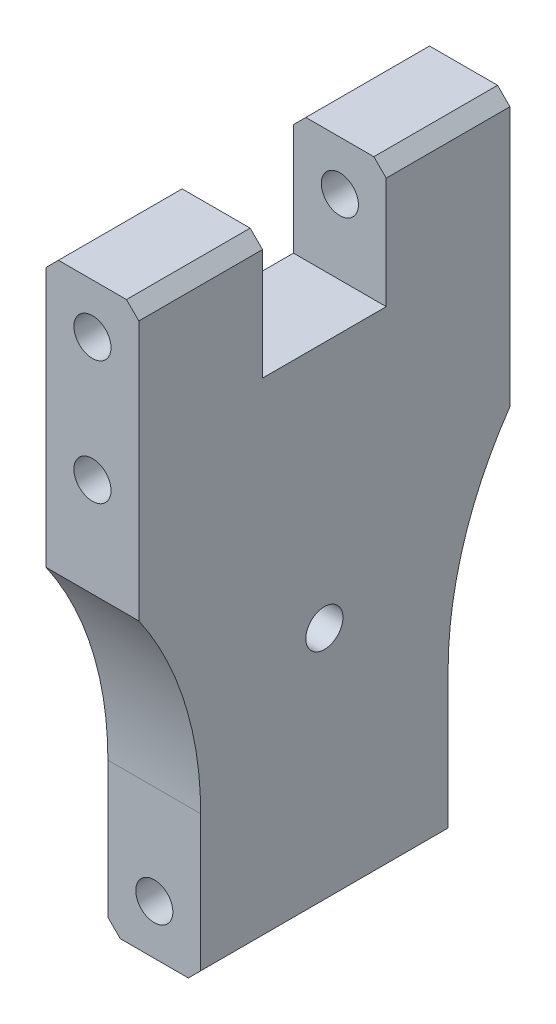
ISO-10303-21;
HEADER;
FILE_DESCRIPTION(('STEP AP214'),'2;1');
FILE_NAME('part.step','',(''),(''),'','','');
FILE_SCHEMA(('AUTOMOTIVE_DESIGN { 1 0 10303 214 1 1 1 1 }'));
ENDSEC;
DATA;
#1=APPLICATION_CONTEXT('core data for automotive mechanical design processes');
#2=APPLICATION_PROTOCOL_DEFINITION('international standard','automotive_design',2000,#1);
#3=PRODUCT_CONTEXT('',#1,'mechanical');
#4=PRODUCT('Part','Part','',(#3));
#5=PRODUCT_RELATED_PRODUCT_CATEGORY('part','',(#4));
#6=PRODUCT_DEFINITION_FORMATION('','',#4);
#7=PRODUCT_DEFINITION_CONTEXT('part definition',#1,'design');
#8=PRODUCT_DEFINITION('design','',#6,#7);
#9=PRODUCT_DEFINITION_SHAPE('','',#8);
#10=(LENGTH_UNIT() NAMED_UNIT(*) SI_UNIT(.MILLI.,.METRE.));
#11=(NAMED_UNIT(*) PLANE_ANGLE_UNIT() SI_UNIT($,.RADIAN.));
#12=(NAMED_UNIT(*) SI_UNIT($,.STERADIAN.) SOLID_ANGLE_UNIT());
#13=UNCERTAINTY_MEASURE_WITH_UNIT(LENGTH_MEASURE(1.E-05),#10,'distance_accuracy_value','');
#14=(GEOMETRIC_REPRESENTATION_CONTEXT(3) GLOBAL_UNCERTAINTY_ASSIGNED_CONTEXT((#13)) GLOBAL_UNIT_ASSIGNED_CONTEXT((#10,
#11,#12)) REPRESENTATION_CONTEXT('',''));
#15=CARTESIAN_POINT('',(0.,0.,0.));
#16=DIRECTION('',(0.,0.,1.));
#17=DIRECTION('',(1.,0.,0.));
#18=AXIS2_PLACEMENT_3D('',#15,#16,#17);
#19=CARTESIAN_POINT('',(19.05,0.,-50.8));
#20=DIRECTION('',(0.,1.,0.));
#21=DIRECTION('',(0.,0.,1.));
#22=AXIS2_PLACEMENT_3D('',#19,#20,#21);
#23=PLANE('',#22);
#24=DIRECTION('',(-1.,0.,0.));
#25=VECTOR('',#24,1.);
#26=CARTESIAN_POINT('',(19.05,0.,0.));
#27=LINE('',#26,#25);
#28=CARTESIAN_POINT('',(16.51,0.,0.));
#29=VERTEX_POINT('',#28);
#30=CARTESIAN_POINT('',(2.54000000000003,0.,0.));
#31=VERTEX_POINT('',#30);
#32=EDGE_CURVE('E202',#29,#31,#27,.T.);
#33=ORIENTED_EDGE('',*,*,#32,.T.);
#34=DIRECTION('',(0.,0.,-1.));
#35=VECTOR('',#34,1.);
#36=CARTESIAN_POINT('',(2.54000000000003,0.,-50.8));
#37=LINE('',#36,#35);
#38=CARTESIAN_POINT('',(2.54000000000003,0.,-50.8));
#39=VERTEX_POINT('',#38);
#40=EDGE_CURVE('E256',#31,#39,#37,.T.);
#41=ORIENTED_EDGE('',*,*,#40,.T.);
#42=DIRECTION('',(-1.,0.,0.));
#43=VECTOR('',#42,1.);
#44=CARTESIAN_POINT('',(19.05,0.,-50.8));
#45=LINE('',#44,#43);
#46=CARTESIAN_POINT('',(16.51,0.,-50.8));
#47=VERTEX_POINT('',#46);
#48=EDGE_CURVE('E178',#47,#39,#45,.T.);
#49=ORIENTED_EDGE('',*,*,#48,.F.);
#50=DIRECTION('',(0.,0.,1.));
#51=VECTOR('',#50,1.);
#52=CARTESIAN_POINT('',(16.51,0.,-50.8));
#53=LINE('',#52,#51);
#54=EDGE_CURVE('E249',#47,#29,#53,.T.);
#55=ORIENTED_EDGE('',*,*,#54,.T.);
#56=EDGE_LOOP('',(#33,#41,#49,#55));
#57=FACE_BOUND('',#56,.T.);
#58=ADVANCED_FACE('F32',(#57),#23,.F.);
#59=CARTESIAN_POINT('',(19.05,0.,-50.8));
#60=DIRECTION('',(0.,0.,1.));
#61=DIRECTION('',(0.,-1.,0.));
#62=AXIS2_PLACEMENT_3D('',#59,#60,#61);
#63=PLANE('',#62);
#64=CARTESIAN_POINT('',(9.525,10.16,-50.8));
#65=DIRECTION('',(0.,0.,1.));
#66=DIRECTION('',(0.,-1.,0.));
#67=AXIS2_PLACEMENT_3D('',#64,#65,#66);
#68=CIRCLE('',#67,3.81);
#69=CARTESIAN_POINT('',(9.525,6.35,-50.8));
#70=VERTEX_POINT('',#69);
#71=EDGE_CURVE('E253',#70,#70,#68,.T.);
#72=ORIENTED_EDGE('',*,*,#71,.T.);
#73=EDGE_LOOP('',(#72));
#74=FACE_BOUND('',#73,.T.);
#75=ORIENTED_EDGE('',*,*,#48,.T.);
#76=DIRECTION('',(-0.707106781186548,0.707106781186547,0.));
#77=VECTOR('',#76,1.);
#78=CARTESIAN_POINT('',(2.54000000000003,0.,-50.8));
#79=LINE('',#78,#77);
#80=CARTESIAN_POINT('',(0.,2.54000000000003,-50.8));
#81=VERTEX_POINT('',#80);
#82=EDGE_CURVE('E261',#39,#81,#79,.T.);
#83=ORIENTED_EDGE('',*,*,#82,.T.);
#84=DIRECTION('',(0.,1.,0.));
#85=VECTOR('',#84,1.);
#86=CARTESIAN_POINT('',(0.,0.,-50.8));
#87=LINE('',#86,#85);
#88=CARTESIAN_POINT('',(0.,30.48,-50.8));
#89=VERTEX_POINT('',#88);
#90=EDGE_CURVE('E175',#81,#89,#87,.T.);
#91=ORIENTED_EDGE('',*,*,#90,.T.);
#92=DIRECTION('',(-1.,0.,0.));
#93=VECTOR('',#92,1.);
#94=CARTESIAN_POINT('',(19.05,30.48,-50.8));
#95=LINE('',#94,#93);
#96=CARTESIAN_POINT('',(19.05,30.48,-50.8));
#97=VERTEX_POINT('',#96);
#98=EDGE_CURVE('E171',#97,#89,#95,.T.);
#99=ORIENTED_EDGE('',*,*,#98,.F.);
#100=DIRECTION('',(0.,1.,0.));
#101=VECTOR('',#100,1.);
#102=CARTESIAN_POINT('',(19.05,0.,-50.8));
#103=LINE('',#102,#101);
#104=CARTESIAN_POINT('',(19.05,2.54000000000003,-50.8));
#105=VERTEX_POINT('',#104);
#106=EDGE_CURVE('E157',#105,#97,#103,.T.);
#107=ORIENTED_EDGE('',*,*,#106,.F.);
#108=DIRECTION('',(0.707106781186548,0.707106781186547,0.));
#109=VECTOR('',#108,1.);
#110=CARTESIAN_POINT('',(19.05,2.54000000000004,-50.8));
#111=LINE('',#110,#109);
#112=EDGE_CURVE('E259',#105,#47,#111,.F.);
#113=ORIENTED_EDGE('',*,*,#112,.T.);
#114=EDGE_LOOP('',(#75,#83,#91,#99,#107,#113));
#115=FACE_BOUND('',#114,.T.);
#116=ADVANCED_FACE('F173',(#74,#115),#63,.F.);
#117=CARTESIAN_POINT('',(19.05,30.48,-122.174));
#118=DIRECTION('',(-1.,0.,0.));
#119=DIRECTION('',(0.,0.,1.));
#120=AXIS2_PLACEMENT_3D('',#117,#118,#119);
#121=CYLINDRICAL_SURFACE('',#120,71.3739999999999);
#122=CARTESIAN_POINT('',(0.,30.48,-122.174));
#123=DIRECTION('',(-1.,0.,0.));
#124=DIRECTION('',(0.,0.,-1.));
#125=AXIS2_PLACEMENT_3D('',#122,#123,#124);
#126=CIRCLE('',#125,71.3739999999999);
#127=CARTESIAN_POINT('',(0.,71.12,-63.5));
#128=VERTEX_POINT('',#127);
#129=EDGE_CURVE('E204',#89,#128,#126,.T.);
#130=ORIENTED_EDGE('',*,*,#129,.T.);
#131=DIRECTION('',(-1.,0.,0.));
#132=VECTOR('',#131,1.);
#133=CARTESIAN_POINT('',(19.05,71.12,-63.5));
#134=LINE('',#133,#132);
#135=CARTESIAN_POINT('',(19.05,71.12,-63.5));
#136=VERTEX_POINT('',#135);
#137=EDGE_CURVE('E179',#136,#128,#134,.T.);
#138=ORIENTED_EDGE('',*,*,#137,.F.);
#139=CARTESIAN_POINT('',(19.05,30.48,-122.174));
#140=DIRECTION('',(-1.,0.,0.));
#141=DIRECTION('',(0.,0.,-1.));
#142=AXIS2_PLACEMENT_3D('',#139,#140,#141);
#143=CIRCLE('',#142,71.3739999999999);
#144=EDGE_CURVE('E163',#97,#136,#143,.T.);
#145=ORIENTED_EDGE('',*,*,#144,.F.);
#146=ORIENTED_EDGE('',*,*,#98,.T.);
#147=EDGE_LOOP('',(#130,#138,#145,#146));
#148=FACE_BOUND('',#147,.T.);
#149=ADVANCED_FACE('F181',(#148),#121,.F.);
#150=CARTESIAN_POINT('',(19.05,127.,-63.5));
#151=DIRECTION('',(0.,0.,1.));
#152=DIRECTION('',(0.,-1.,0.));
#153=AXIS2_PLACEMENT_3D('',#150,#151,#152);
#154=PLANE('',#153);
#155=CARTESIAN_POINT('',(9.525,91.44,-63.5));
#156=DIRECTION('',(0.,0.,1.));
#157=DIRECTION('',(1.,0.,0.));
#158=AXIS2_PLACEMENT_3D('',#155,#156,#157);
#159=CIRCLE('',#158,3.81);
#160=CARTESIAN_POINT('',(13.335,91.44,-63.5));
#161=VERTEX_POINT('',#160);
#162=EDGE_CURVE('E436',#161,#161,#159,.T.);
#163=ORIENTED_EDGE('',*,*,#162,.T.);
#164=EDGE_LOOP('',(#163));
#165=FACE_BOUND('',#164,.T.);
#166=CARTESIAN_POINT('',(9.525,116.84,-63.5));
#167=DIRECTION('',(0.,0.,1.));
#168=DIRECTION('',(1.,0.,0.));
#169=AXIS2_PLACEMENT_3D('',#166,#167,#168);
#170=CIRCLE('',#169,3.81);
#171=CARTESIAN_POINT('',(13.335,116.84,-63.5));
#172=VERTEX_POINT('',#171);
#173=EDGE_CURVE('E445',#172,#172,#170,.T.);
#174=ORIENTED_EDGE('',*,*,#173,.T.);
#175=EDGE_LOOP('',(#174));
#176=FACE_BOUND('',#175,.T.);
#177=DIRECTION('',(0.,1.,0.));
#178=VECTOR('',#177,1.);
#179=CARTESIAN_POINT('',(0.,127.,-63.5));
#180=LINE('',#179,#178);
#181=CARTESIAN_POINT('',(0.,124.46,-63.5));
#182=VERTEX_POINT('',#181);
#183=EDGE_CURVE('E207',#128,#182,#180,.T.);
#184=ORIENTED_EDGE('',*,*,#183,.T.);
#185=DIRECTION('',(0.707106781186547,0.707106781186547,0.));
#186=VECTOR('',#185,1.);
#187=CARTESIAN_POINT('',(2.54000000000003,127.,-63.5));
#188=LINE('',#187,#186);
#189=CARTESIAN_POINT('',(2.54000000000003,127.,-63.5));
#190=VERTEX_POINT('',#189);
#191=EDGE_CURVE('E11',#182,#190,#188,.T.);
#192=ORIENTED_EDGE('',*,*,#191,.T.);
#193=DIRECTION('',(-1.,0.,0.));
#194=VECTOR('',#193,1.);
#195=CARTESIAN_POINT('',(19.05,127.,-63.5));
#196=LINE('',#195,#194);
#197=CARTESIAN_POINT('',(16.51,127.,-63.5));
#198=VERTEX_POINT('',#197);
#199=EDGE_CURVE('E245',#198,#190,#196,.T.);
#200=ORIENTED_EDGE('',*,*,#199,.F.);
#201=DIRECTION('',(-0.707106781186549,0.707106781186546,0.));
#202=VECTOR('',#201,1.);
#203=CARTESIAN_POINT('',(19.05,124.46,-63.5));
#204=LINE('',#203,#202);
#205=CARTESIAN_POINT('',(19.05,124.46,-63.5));
#206=VERTEX_POINT('',#205);
#207=EDGE_CURVE('E40',#198,#206,#204,.F.);
#208=ORIENTED_EDGE('',*,*,#207,.T.);
#209=DIRECTION('',(0.,1.,0.));
#210=VECTOR('',#209,1.);
#211=CARTESIAN_POINT('',(19.05,127.,-63.5));
#212=LINE('',#211,#210);
#213=EDGE_CURVE('E184',#136,#206,#212,.T.);
#214=ORIENTED_EDGE('',*,*,#213,.F.);
#215=ORIENTED_EDGE('',*,*,#137,.T.);
#216=EDGE_LOOP('',(#184,#192,#200,#208,#214,#215));
#217=FACE_BOUND('',#216,.T.);
#218=ADVANCED_FACE('F301',(#165,#176,#217),#154,.F.);
#219=CARTESIAN_POINT('',(19.05,127.,-63.5));
#220=DIRECTION('',(0.,-1.,0.));
#221=DIRECTION('',(0.,0.,-1.));
#222=AXIS2_PLACEMENT_3D('',#219,#220,#221);
#223=PLANE('',#222);
#224=ORIENTED_EDGE('',*,*,#199,.T.);
#225=DIRECTION('',(0.,0.,1.));
#226=VECTOR('',#225,1.);
#227=CARTESIAN_POINT('',(2.54000000000003,127.,-38.1));
#228=LINE('',#227,#226);
#229=CARTESIAN_POINT('',(2.54000000000002,127.,-38.1));
#230=VERTEX_POINT('',#229);
#231=EDGE_CURVE('E294',#190,#230,#228,.T.);
#232=ORIENTED_EDGE('',*,*,#231,.T.);
#233=DIRECTION('',(-1.,0.,0.));
#234=VECTOR('',#233,1.);
#235=CARTESIAN_POINT('',(19.05,127.,-38.1));
#236=LINE('',#235,#234);
#237=CARTESIAN_POINT('',(16.51,127.,-38.1));
#238=VERTEX_POINT('',#237);
#239=EDGE_CURVE('E242',#238,#230,#236,.T.);
#240=ORIENTED_EDGE('',*,*,#239,.F.);
#241=DIRECTION('',(0.,0.,-1.));
#242=VECTOR('',#241,1.);
#243=CARTESIAN_POINT('',(16.51,127.,-63.5));
#244=LINE('',#243,#242);
#245=EDGE_CURVE('E52',#238,#198,#244,.T.);
#246=ORIENTED_EDGE('',*,*,#245,.T.);
#247=EDGE_LOOP('',(#224,#232,#240,#246));
#248=FACE_BOUND('',#247,.T.);
#249=ADVANCED_FACE('F309',(#248),#223,.F.);
#250=CARTESIAN_POINT('',(19.05,127.,-38.1));
#251=DIRECTION('',(0.,0.,-1.));
#252=DIRECTION('',(0.,1.,0.));
#253=AXIS2_PLACEMENT_3D('',#250,#251,#252);
#254=PLANE('',#253);
#255=CARTESIAN_POINT('',(9.525,116.84,-38.1));
#256=DIRECTION('',(0.,0.,-1.));
#257=DIRECTION('',(0.,1.,0.));
#258=AXIS2_PLACEMENT_3D('',#255,#256,#257);
#259=CIRCLE('',#258,3.81);
#260=CARTESIAN_POINT('',(9.525,120.65,-38.1));
#261=VERTEX_POINT('',#260);
#262=EDGE_CURVE('E205',#261,#261,#259,.T.);
#263=ORIENTED_EDGE('',*,*,#262,.T.);
#264=EDGE_LOOP('',(#263));
#265=FACE_BOUND('',#264,.T.);
#266=ORIENTED_EDGE('',*,*,#239,.T.);
#267=DIRECTION('',(-0.707106781186547,-0.707106781186547,0.));
#268=VECTOR('',#267,1.);
#269=CARTESIAN_POINT('',(2.54000000000002,127.,-38.1));
#270=LINE('',#269,#268);
#271=CARTESIAN_POINT('',(0.,124.46,-38.1));
#272=VERTEX_POINT('',#271);
#273=EDGE_CURVE('E299',#230,#272,#270,.T.);
#274=ORIENTED_EDGE('',*,*,#273,.T.);
#275=DIRECTION('',(0.,-1.,0.));
#276=VECTOR('',#275,1.);
#277=CARTESIAN_POINT('',(0.,127.,-38.1));
#278=LINE('',#277,#276);
#279=CARTESIAN_POINT('',(0.,101.6,-38.1));
#280=VERTEX_POINT('',#279);
#281=EDGE_CURVE('E209',#272,#280,#278,.T.);
#282=ORIENTED_EDGE('',*,*,#281,.T.);
#283=DIRECTION('',(-1.,0.,0.));
#284=VECTOR('',#283,1.);
#285=CARTESIAN_POINT('',(19.05,101.6,-38.1));
#286=LINE('',#285,#284);
#287=CARTESIAN_POINT('',(19.05,101.6,-38.1));
#288=VERTEX_POINT('',#287);
#289=EDGE_CURVE('E239',#288,#280,#286,.T.);
#290=ORIENTED_EDGE('',*,*,#289,.F.);
#291=DIRECTION('',(0.,-1.,0.));
#292=VECTOR('',#291,1.);
#293=CARTESIAN_POINT('',(19.05,127.,-38.1));
#294=LINE('',#293,#292);
#295=CARTESIAN_POINT('',(19.05,124.46,-38.1));
#296=VERTEX_POINT('',#295);
#297=EDGE_CURVE('E186',#296,#288,#294,.T.);
#298=ORIENTED_EDGE('',*,*,#297,.F.);
#299=DIRECTION('',(0.707106781186549,-0.707106781186546,0.));
#300=VECTOR('',#299,1.);
#301=CARTESIAN_POINT('',(19.05,124.46,-38.1));
#302=LINE('',#301,#300);
#303=EDGE_CURVE('E297',#296,#238,#302,.F.);
#304=ORIENTED_EDGE('',*,*,#303,.T.);
#305=EDGE_LOOP('',(#266,#274,#282,#290,#298,#304));
#306=FACE_BOUND('',#305,.T.);
#307=ADVANCED_FACE('F307',(#265,#306),#254,.F.);
#308=CARTESIAN_POINT('',(19.05,101.6,-12.7));
#309=DIRECTION('',(0.,-1.,0.));
#310=DIRECTION('',(0.,0.,-1.));
#311=AXIS2_PLACEMENT_3D('',#308,#309,#310);
#312=PLANE('',#311);
#313=DIRECTION('',(0.,0.,1.));
#314=VECTOR('',#313,1.);
#315=CARTESIAN_POINT('',(0.,101.6,-12.7));
#316=LINE('',#315,#314);
#317=CARTESIAN_POINT('',(0.,101.6,-12.7));
#318=VERTEX_POINT('',#317);
#319=EDGE_CURVE('E211',#280,#318,#316,.T.);
#320=ORIENTED_EDGE('',*,*,#319,.T.);
#321=DIRECTION('',(-1.,0.,0.));
#322=VECTOR('',#321,1.);
#323=CARTESIAN_POINT('',(19.05,101.6,-12.7));
#324=LINE('',#323,#322);
#325=CARTESIAN_POINT('',(19.05,101.6,-12.7));
#326=VERTEX_POINT('',#325);
#327=EDGE_CURVE('E236',#326,#318,#324,.T.);
#328=ORIENTED_EDGE('',*,*,#327,.F.);
#329=DIRECTION('',(0.,0.,1.));
#330=VECTOR('',#329,1.);
#331=CARTESIAN_POINT('',(19.05,101.6,-12.7));
#332=LINE('',#331,#330);
#333=EDGE_CURVE('E191',#288,#326,#332,.T.);
#334=ORIENTED_EDGE('',*,*,#333,.F.);
#335=ORIENTED_EDGE('',*,*,#289,.T.);
#336=EDGE_LOOP('',(#320,#328,#334,#335));
#337=FACE_BOUND('',#336,.T.);
#338=ADVANCED_FACE('F322',(#337),#312,.F.);
#339=CARTESIAN_POINT('',(19.05,127.,-12.7));
#340=DIRECTION('',(0.,0.,1.));
#341=DIRECTION('',(0.,-1.,0.));
#342=AXIS2_PLACEMENT_3D('',#339,#340,#341);
#343=PLANE('',#342);
#344=CARTESIAN_POINT('',(9.525,116.84,-12.7));
#345=DIRECTION('',(0.,0.,1.));
#346=DIRECTION('',(0.,-1.,0.));
#347=AXIS2_PLACEMENT_3D('',#344,#345,#346);
#348=CIRCLE('',#347,3.81);
#349=CARTESIAN_POINT('',(9.525,113.03,-12.7));
#350=VERTEX_POINT('',#349);
#351=EDGE_CURVE('E448',#350,#350,#348,.T.);
#352=ORIENTED_EDGE('',*,*,#351,.T.);
#353=EDGE_LOOP('',(#352));
#354=FACE_BOUND('',#353,.T.);
#355=DIRECTION('',(0.,1.,0.));
#356=VECTOR('',#355,1.);
#357=CARTESIAN_POINT('',(0.,127.,-12.7));
#358=LINE('',#357,#356);
#359=CARTESIAN_POINT('',(0.,124.46,-12.7));
#360=VERTEX_POINT('',#359);
#361=EDGE_CURVE('E213',#318,#360,#358,.T.);
#362=ORIENTED_EDGE('',*,*,#361,.T.);
#363=DIRECTION('',(0.707106781186547,0.707106781186547,0.));
#364=VECTOR('',#363,1.);
#365=CARTESIAN_POINT('',(2.54000000000003,127.,-12.7));
#366=LINE('',#365,#364);
#367=CARTESIAN_POINT('',(2.54000000000003,127.,-12.7));
#368=VERTEX_POINT('',#367);
#369=EDGE_CURVE('E291',#360,#368,#366,.T.);
#370=ORIENTED_EDGE('',*,*,#369,.T.);
#371=DIRECTION('',(-1.,0.,0.));
#372=VECTOR('',#371,1.);
#373=CARTESIAN_POINT('',(19.05,127.,-12.7));
#374=LINE('',#373,#372);
#375=CARTESIAN_POINT('',(16.51,127.,-12.7));
#376=VERTEX_POINT('',#375);
#377=EDGE_CURVE('E233',#376,#368,#374,.T.);
#378=ORIENTED_EDGE('',*,*,#377,.F.);
#379=DIRECTION('',(-0.707106781186549,0.707106781186546,0.));
#380=VECTOR('',#379,1.);
#381=CARTESIAN_POINT('',(19.05,124.46,-12.7));
#382=LINE('',#381,#380);
#383=CARTESIAN_POINT('',(19.05,124.46,-12.7));
#384=VERTEX_POINT('',#383);
#385=EDGE_CURVE('E289',#376,#384,#382,.F.);
#386=ORIENTED_EDGE('',*,*,#385,.T.);
#387=DIRECTION('',(0.,1.,0.));
#388=VECTOR('',#387,1.);
#389=CARTESIAN_POINT('',(19.05,127.,-12.7));
#390=LINE('',#389,#388);
#391=EDGE_CURVE('E193',#326,#384,#390,.T.);
#392=ORIENTED_EDGE('',*,*,#391,.F.);
#393=ORIENTED_EDGE('',*,*,#327,.T.);
#394=EDGE_LOOP('',(#362,#370,#378,#386,#392,#393));
#395=FACE_BOUND('',#394,.T.);
#396=ADVANCED_FACE('F326',(#354,#395),#343,.F.);
#397=CARTESIAN_POINT('',(19.05,127.,12.7));
#398=DIRECTION('',(0.,-1.,0.));
#399=DIRECTION('',(0.,0.,-1.));
#400=AXIS2_PLACEMENT_3D('',#397,#398,#399);
#401=PLANE('',#400);
#402=ORIENTED_EDGE('',*,*,#377,.T.);
#403=DIRECTION('',(0.,0.,1.));
#404=VECTOR('',#403,1.);
#405=CARTESIAN_POINT('',(2.54000000000003,127.,12.7));
#406=LINE('',#405,#404);
#407=CARTESIAN_POINT('',(2.54000000000003,127.,12.7));
#408=VERTEX_POINT('',#407);
#409=EDGE_CURVE('E282',#368,#408,#406,.T.);
#410=ORIENTED_EDGE('',*,*,#409,.T.);
#411=DIRECTION('',(-1.,0.,0.));
#412=VECTOR('',#411,1.);
#413=CARTESIAN_POINT('',(19.05,127.,12.7));
#414=LINE('',#413,#412);
#415=CARTESIAN_POINT('',(16.51,127.,12.7));
#416=VERTEX_POINT('',#415);
#417=EDGE_CURVE('E230',#416,#408,#414,.T.);
#418=ORIENTED_EDGE('',*,*,#417,.F.);
#419=DIRECTION('',(0.,0.,-1.));
#420=VECTOR('',#419,1.);
#421=CARTESIAN_POINT('',(16.51,127.,12.7));
#422=LINE('',#421,#420);
#423=EDGE_CURVE('E280',#416,#376,#422,.T.);
#424=ORIENTED_EDGE('',*,*,#423,.T.);
#425=EDGE_LOOP('',(#402,#410,#418,#424));
#426=FACE_BOUND('',#425,.T.);
#427=ADVANCED_FACE('F339',(#426),#401,.F.);
#428=CARTESIAN_POINT('',(19.05,127.,12.7));
#429=DIRECTION('',(0.,0.,-1.));
#430=DIRECTION('',(0.,1.,0.));
#431=AXIS2_PLACEMENT_3D('',#428,#429,#430);
#432=PLANE('',#431);
#433=CARTESIAN_POINT('',(9.525,91.44,12.7));
#434=DIRECTION('',(0.,0.,1.));
#435=DIRECTION('',(1.,0.,0.));
#436=AXIS2_PLACEMENT_3D('',#433,#434,#435);
#437=CIRCLE('',#436,3.81);
#438=CARTESIAN_POINT('',(13.335,91.44,12.7));
#439=VERTEX_POINT('',#438);
#440=EDGE_CURVE('E433',#439,#439,#437,.T.);
#441=ORIENTED_EDGE('',*,*,#440,.F.);
#442=EDGE_LOOP('',(#441));
#443=FACE_BOUND('',#442,.T.);
#444=CARTESIAN_POINT('',(9.525,116.84,12.7));
#445=DIRECTION('',(0.,0.,1.));
#446=DIRECTION('',(1.,0.,0.));
#447=AXIS2_PLACEMENT_3D('',#444,#445,#446);
#448=CIRCLE('',#447,3.81);
#449=CARTESIAN_POINT('',(13.335,116.84,12.7));
#450=VERTEX_POINT('',#449);
#451=EDGE_CURVE('E443',#450,#450,#448,.T.);
#452=ORIENTED_EDGE('',*,*,#451,.F.);
#453=EDGE_LOOP('',(#452));
#454=FACE_BOUND('',#453,.T.);
#455=ORIENTED_EDGE('',*,*,#417,.T.);
#456=DIRECTION('',(-0.707106781186548,-0.707106781186548,0.));
#457=VECTOR('',#456,1.);
#458=CARTESIAN_POINT('',(2.54000000000003,127.,12.7));
#459=LINE('',#458,#457);
#460=CARTESIAN_POINT('',(0.,124.46,12.7));
#461=VERTEX_POINT('',#460);
#462=EDGE_CURVE('E287',#408,#461,#459,.T.);
#463=ORIENTED_EDGE('',*,*,#462,.T.);
#464=DIRECTION('',(0.,-1.,0.));
#465=VECTOR('',#464,1.);
#466=CARTESIAN_POINT('',(0.,127.,12.7));
#467=LINE('',#466,#465);
#468=CARTESIAN_POINT('',(0.,71.12,12.7));
#469=VERTEX_POINT('',#468);
#470=EDGE_CURVE('E216',#461,#469,#467,.T.);
#471=ORIENTED_EDGE('',*,*,#470,.T.);
#472=DIRECTION('',(-1.,0.,0.));
#473=VECTOR('',#472,1.);
#474=CARTESIAN_POINT('',(19.05,71.12,12.7));
#475=LINE('',#474,#473);
#476=CARTESIAN_POINT('',(19.05,71.12,12.7));
#477=VERTEX_POINT('',#476);
#478=EDGE_CURVE('E227',#477,#469,#475,.T.);
#479=ORIENTED_EDGE('',*,*,#478,.F.);
#480=DIRECTION('',(0.,-1.,0.));
#481=VECTOR('',#480,1.);
#482=CARTESIAN_POINT('',(19.05,127.,12.7));
#483=LINE('',#482,#481);
#484=CARTESIAN_POINT('',(19.05,124.46,12.7));
#485=VERTEX_POINT('',#484);
#486=EDGE_CURVE('E196',#485,#477,#483,.T.);
#487=ORIENTED_EDGE('',*,*,#486,.F.);
#488=DIRECTION('',(0.70710678118655,-0.707106781186546,0.));
#489=VECTOR('',#488,1.);
#490=CARTESIAN_POINT('',(19.05,124.46,12.7));
#491=LINE('',#490,#489);
#492=EDGE_CURVE('E285',#485,#416,#491,.F.);
#493=ORIENTED_EDGE('',*,*,#492,.T.);
#494=EDGE_LOOP('',(#455,#463,#471,#479,#487,#493));
#495=FACE_BOUND('',#494,.T.);
#496=ADVANCED_FACE('F336',(#443,#454,#495),#432,.F.);
#497=CARTESIAN_POINT('',(19.05,30.48,71.3739999999999));
#498=DIRECTION('',(-1.,0.,0.));
#499=DIRECTION('',(0.,0.,1.));
#500=AXIS2_PLACEMENT_3D('',#497,#498,#499);
#501=CYLINDRICAL_SURFACE('',#500,71.3739999999999);
#502=CARTESIAN_POINT('',(0.,30.48,71.3739999999999));
#503=DIRECTION('',(-1.,0.,0.));
#504=DIRECTION('',(0.,0.,1.));
#505=AXIS2_PLACEMENT_3D('',#502,#503,#504);
#506=CIRCLE('',#505,71.3739999999999);
#507=CARTESIAN_POINT('',(0.,30.48,0.));
#508=VERTEX_POINT('',#507);
#509=EDGE_CURVE('E218',#469,#508,#506,.T.);
#510=ORIENTED_EDGE('',*,*,#509,.T.);
#511=DIRECTION('',(-1.,0.,0.));
#512=VECTOR('',#511,1.);
#513=CARTESIAN_POINT('',(19.05,30.48,0.));
#514=LINE('',#513,#512);
#515=CARTESIAN_POINT('',(19.05,30.48,0.));
#516=VERTEX_POINT('',#515);
#517=EDGE_CURVE('E224',#516,#508,#514,.T.);
#518=ORIENTED_EDGE('',*,*,#517,.F.);
#519=CARTESIAN_POINT('',(19.05,30.48,71.3739999999999));
#520=DIRECTION('',(-1.,0.,0.));
#521=DIRECTION('',(0.,0.,1.));
#522=AXIS2_PLACEMENT_3D('',#519,#520,#521);
#523=CIRCLE('',#522,71.3739999999999);
#524=EDGE_CURVE('E198',#477,#516,#523,.T.);
#525=ORIENTED_EDGE('',*,*,#524,.F.);
#526=ORIENTED_EDGE('',*,*,#478,.T.);
#527=EDGE_LOOP('',(#510,#518,#525,#526));
#528=FACE_BOUND('',#527,.T.);
#529=ADVANCED_FACE('F349',(#528),#501,.F.);
#530=CARTESIAN_POINT('',(19.05,0.,0.));
#531=DIRECTION('',(0.,0.,-1.));
#532=DIRECTION('',(-1.,0.,0.));
#533=AXIS2_PLACEMENT_3D('',#530,#531,#532);
#534=PLANE('',#533);
#535=CARTESIAN_POINT('',(9.525,10.16,0.));
#536=DIRECTION('',(0.,0.,-1.));
#537=DIRECTION('',(-1.,0.,0.));
#538=AXIS2_PLACEMENT_3D('',#535,#536,#537);
#539=CIRCLE('',#538,3.81);
#540=CARTESIAN_POINT('',(5.71500000000001,10.16,0.));
#541=VERTEX_POINT('',#540);
#542=EDGE_CURVE('E250',#541,#541,#539,.T.);
#543=ORIENTED_EDGE('',*,*,#542,.T.);
#544=EDGE_LOOP('',(#543));
#545=FACE_BOUND('',#544,.T.);
#546=DIRECTION('',(0.,-1.,0.));
#547=VECTOR('',#546,1.);
#548=CARTESIAN_POINT('',(0.,0.,0.));
#549=LINE('',#548,#547);
#550=CARTESIAN_POINT('',(0.,2.54000000000003,0.));
#551=VERTEX_POINT('',#550);
#552=EDGE_CURVE('E168',#508,#551,#549,.T.);
#553=ORIENTED_EDGE('',*,*,#552,.T.);
#554=DIRECTION('',(0.707106781186548,-0.707106781186547,0.));
#555=VECTOR('',#554,1.);
#556=CARTESIAN_POINT('',(2.54000000000003,0.,0.));
#557=LINE('',#556,#555);
#558=EDGE_CURVE('E271',#551,#31,#557,.T.);
#559=ORIENTED_EDGE('',*,*,#558,.T.);
#560=ORIENTED_EDGE('',*,*,#32,.F.);
#561=DIRECTION('',(-0.707106781186548,-0.707106781186547,0.));
#562=VECTOR('',#561,1.);
#563=CARTESIAN_POINT('',(19.05,2.54000000000002,0.));
#564=LINE('',#563,#562);
#565=CARTESIAN_POINT('',(19.05,2.54000000000002,0.));
#566=VERTEX_POINT('',#565);
#567=EDGE_CURVE('E269',#29,#566,#564,.F.);
#568=ORIENTED_EDGE('',*,*,#567,.T.);
#569=DIRECTION('',(0.,-1.,0.));
#570=VECTOR('',#569,1.);
#571=CARTESIAN_POINT('',(19.05,0.,0.));
#572=LINE('',#571,#570);
#573=EDGE_CURVE('E200',#516,#566,#572,.T.);
#574=ORIENTED_EDGE('',*,*,#573,.F.);
#575=ORIENTED_EDGE('',*,*,#517,.T.);
#576=EDGE_LOOP('',(#553,#559,#560,#568,#574,#575));
#577=FACE_BOUND('',#576,.T.);
#578=ADVANCED_FACE('F353',(#545,#577),#534,.F.);
#579=CARTESIAN_POINT('',(19.05,30.48,71.3739999999999));
#580=DIRECTION('',(-1.,0.,0.));
#581=DIRECTION('',(0.,0.,1.));
#582=AXIS2_PLACEMENT_3D('',#579,#580,#581);
#583=PLANE('',#582);
#584=CARTESIAN_POINT('',(19.05,50.8,-25.4));
#585=DIRECTION('',(1.,0.,0.));
#586=DIRECTION('',(0.,0.,-1.));
#587=AXIS2_PLACEMENT_3D('',#584,#585,#586);
#588=CIRCLE('',#587,3.81);
#589=CARTESIAN_POINT('',(19.05,50.8,-29.21));
#590=VERTEX_POINT('',#589);
#591=EDGE_CURVE('E440',#590,#590,#588,.T.);
#592=ORIENTED_EDGE('',*,*,#591,.F.);
#593=EDGE_LOOP('',(#592));
#594=FACE_BOUND('',#593,.T.);
#595=ORIENTED_EDGE('',*,*,#573,.T.);
#596=DIRECTION('',(0.,0.,-1.));
#597=VECTOR('',#596,1.);
#598=CARTESIAN_POINT('',(19.05,2.54000000000002,71.3739999999999));
#599=LINE('',#598,#597);
#600=EDGE_CURVE('E166',#566,#105,#599,.T.);
#601=ORIENTED_EDGE('',*,*,#600,.T.);
#602=ORIENTED_EDGE('',*,*,#106,.T.);
#603=ORIENTED_EDGE('',*,*,#144,.T.);
#604=ORIENTED_EDGE('',*,*,#213,.T.);
#605=DIRECTION('',(0.,0.,1.));
#606=VECTOR('',#605,1.);
#607=CARTESIAN_POINT('',(19.05,124.46,71.3739999999999));
#608=LINE('',#607,#606);
#609=EDGE_CURVE('E276',#206,#296,#608,.T.);
#610=ORIENTED_EDGE('',*,*,#609,.T.);
#611=ORIENTED_EDGE('',*,*,#297,.T.);
#612=ORIENTED_EDGE('',*,*,#333,.T.);
#613=ORIENTED_EDGE('',*,*,#391,.T.);
#614=DIRECTION('',(0.,0.,1.));
#615=VECTOR('',#614,1.);
#616=CARTESIAN_POINT('',(19.05,124.46,71.3739999999999));
#617=LINE('',#616,#615);
#618=EDGE_CURVE('E273',#384,#485,#617,.T.);
#619=ORIENTED_EDGE('',*,*,#618,.T.);
#620=ORIENTED_EDGE('',*,*,#486,.T.);
#621=ORIENTED_EDGE('',*,*,#524,.T.);
#622=EDGE_LOOP('',(#595,#601,#602,#603,#604,#610,#611,#612,#613,#619,#620,#621));
#623=FACE_BOUND('',#622,.T.);
#624=ADVANCED_FACE('F160',(#594,#623),#583,.F.);
#625=CARTESIAN_POINT('',(0.,30.48,71.3739999999999));
#626=DIRECTION('',(-1.,0.,0.));
#627=DIRECTION('',(0.,0.,1.));
#628=AXIS2_PLACEMENT_3D('',#625,#626,#627);
#629=PLANE('',#628);
#630=CARTESIAN_POINT('',(0.,50.8,-25.4));
#631=DIRECTION('',(1.,0.,0.));
#632=DIRECTION('',(0.,0.,-1.));
#633=AXIS2_PLACEMENT_3D('',#630,#631,#632);
#634=CIRCLE('',#633,3.81);
#635=CARTESIAN_POINT('',(0.,50.8,-29.21));
#636=VERTEX_POINT('',#635);
#637=EDGE_CURVE('E254',#636,#636,#634,.T.);
#638=ORIENTED_EDGE('',*,*,#637,.T.);
#639=EDGE_LOOP('',(#638));
#640=FACE_BOUND('',#639,.T.);
#641=ORIENTED_EDGE('',*,*,#90,.F.);
#642=DIRECTION('',(0.,0.,1.));
#643=VECTOR('',#642,1.);
#644=CARTESIAN_POINT('',(0.,2.54000000000003,0.));
#645=LINE('',#644,#643);
#646=EDGE_CURVE('E267',#81,#551,#645,.T.);
#647=ORIENTED_EDGE('',*,*,#646,.T.);
#648=ORIENTED_EDGE('',*,*,#552,.F.);
#649=ORIENTED_EDGE('',*,*,#509,.F.);
#650=ORIENTED_EDGE('',*,*,#470,.F.);
#651=DIRECTION('',(0.,0.,-1.));
#652=VECTOR('',#651,1.);
#653=CARTESIAN_POINT('',(0.,124.46,-12.7));
#654=LINE('',#653,#652);
#655=EDGE_CURVE('E265',#461,#360,#654,.T.);
#656=ORIENTED_EDGE('',*,*,#655,.T.);
#657=ORIENTED_EDGE('',*,*,#361,.F.);
#658=ORIENTED_EDGE('',*,*,#319,.F.);
#659=ORIENTED_EDGE('',*,*,#281,.F.);
#660=DIRECTION('',(0.,0.,-1.));
#661=VECTOR('',#660,1.);
#662=CARTESIAN_POINT('',(0.,124.46,-63.5));
#663=LINE('',#662,#661);
#664=EDGE_CURVE('E263',#272,#182,#663,.T.);
#665=ORIENTED_EDGE('',*,*,#664,.T.);
#666=ORIENTED_EDGE('',*,*,#183,.F.);
#667=ORIENTED_EDGE('',*,*,#129,.F.);
#668=EDGE_LOOP('',(#641,#647,#648,#649,#650,#656,#657,#658,#659,#665,#666,#667));
#669=FACE_BOUND('',#668,.T.);
#670=ADVANCED_FACE('F317',(#640,#669),#629,.T.);
#671=CARTESIAN_POINT('',(9.525,116.84,-63.5));
#672=DIRECTION('',(0.,0.,1.));
#673=DIRECTION('',(1.,0.,0.));
#674=AXIS2_PLACEMENT_3D('',#671,#672,#673);
#675=CYLINDRICAL_SURFACE('',#674,3.81);
#676=ORIENTED_EDGE('',*,*,#451,.T.);
#677=EDGE_LOOP('',(#676));
#678=FACE_BOUND('',#677,.T.);
#679=ORIENTED_EDGE('',*,*,#351,.F.);
#680=EDGE_LOOP('',(#679));
#681=FACE_BOUND('',#680,.T.);
#682=ADVANCED_FACE('F412',(#678,#681),#675,.F.);
#683=ORIENTED_EDGE('',*,*,#173,.F.);
#684=EDGE_LOOP('',(#683));
#685=FACE_BOUND('',#684,.T.);
#686=ORIENTED_EDGE('',*,*,#262,.F.);
#687=EDGE_LOOP('',(#686));
#688=FACE_BOUND('',#687,.T.);
#689=ADVANCED_FACE('F417',(#685,#688),#675,.F.);
#690=CARTESIAN_POINT('',(9.525,91.44,-63.5));
#691=DIRECTION('',(0.,0.,1.));
#692=DIRECTION('',(1.,0.,0.));
#693=AXIS2_PLACEMENT_3D('',#690,#691,#692);
#694=CYLINDRICAL_SURFACE('',#693,3.81);
#695=ORIENTED_EDGE('',*,*,#162,.F.);
#696=EDGE_LOOP('',(#695));
#697=FACE_BOUND('',#696,.T.);
#698=ORIENTED_EDGE('',*,*,#440,.T.);
#699=EDGE_LOOP('',(#698));
#700=FACE_BOUND('',#699,.T.);
#701=ADVANCED_FACE('F420',(#697,#700),#694,.F.);
#702=CARTESIAN_POINT('',(9.525,10.16,-63.5));
#703=DIRECTION('',(0.,0.,1.));
#704=DIRECTION('',(1.,0.,0.));
#705=AXIS2_PLACEMENT_3D('',#702,#703,#704);
#706=CYLINDRICAL_SURFACE('',#705,3.81);
#707=ORIENTED_EDGE('',*,*,#542,.F.);
#708=EDGE_LOOP('',(#707));
#709=FACE_BOUND('',#708,.T.);
#710=ORIENTED_EDGE('',*,*,#71,.F.);
#711=EDGE_LOOP('',(#710));
#712=FACE_BOUND('',#711,.T.);
#713=ADVANCED_FACE('F374',(#709,#712),#706,.F.);
#714=CARTESIAN_POINT('',(0.,50.8,-25.4));
#715=DIRECTION('',(1.,0.,0.));
#716=DIRECTION('',(0.,0.,-1.));
#717=AXIS2_PLACEMENT_3D('',#714,#715,#716);
#718=CYLINDRICAL_SURFACE('',#717,3.81);
#719=ORIENTED_EDGE('',*,*,#637,.F.);
#720=EDGE_LOOP('',(#719));
#721=FACE_BOUND('',#720,.T.);
#722=ORIENTED_EDGE('',*,*,#591,.T.);
#723=EDGE_LOOP('',(#722));
#724=FACE_BOUND('',#723,.T.);
#725=ADVANCED_FACE('F367',(#721,#724),#718,.F.);
#726=CARTESIAN_POINT('',(2.54000000000003,0.,-50.8));
#727=DIRECTION('',(-0.707106781186547,-0.707106781186548,0.));
#728=DIRECTION('',(0.707106781186548,-0.707106781186547,0.));
#729=AXIS2_PLACEMENT_3D('',#726,#727,#728);
#730=PLANE('',#729);
#731=ORIENTED_EDGE('',*,*,#558,.F.);
#732=ORIENTED_EDGE('',*,*,#646,.F.);
#733=ORIENTED_EDGE('',*,*,#82,.F.);
#734=ORIENTED_EDGE('',*,*,#40,.F.);
#735=EDGE_LOOP('',(#731,#732,#733,#734));
#736=FACE_BOUND('',#735,.T.);
#737=ADVANCED_FACE('F364',(#736),#730,.T.);
#738=CARTESIAN_POINT('',(19.05,2.54000000000002,71.3739999999999));
#739=DIRECTION('',(-0.707106781186547,0.707106781186548,0.));
#740=DIRECTION('',(-0.707106781186548,-0.707106781186547,0.));
#741=AXIS2_PLACEMENT_3D('',#738,#739,#740);
#742=PLANE('',#741);
#743=ORIENTED_EDGE('',*,*,#567,.F.);
#744=ORIENTED_EDGE('',*,*,#54,.F.);
#745=ORIENTED_EDGE('',*,*,#112,.F.);
#746=ORIENTED_EDGE('',*,*,#600,.F.);
#747=EDGE_LOOP('',(#743,#744,#745,#746));
#748=FACE_BOUND('',#747,.T.);
#749=ADVANCED_FACE('F358',(#748),#742,.F.);
#750=CARTESIAN_POINT('',(2.54000000000003,127.,12.7));
#751=DIRECTION('',(-0.707106781186547,0.707106781186547,0.));
#752=DIRECTION('',(-0.707106781186548,-0.707106781186548,0.));
#753=AXIS2_PLACEMENT_3D('',#750,#751,#752);
#754=PLANE('',#753);
#755=ORIENTED_EDGE('',*,*,#369,.F.);
#756=ORIENTED_EDGE('',*,*,#655,.F.);
#757=ORIENTED_EDGE('',*,*,#462,.F.);
#758=ORIENTED_EDGE('',*,*,#409,.F.);
#759=EDGE_LOOP('',(#755,#756,#757,#758));
#760=FACE_BOUND('',#759,.T.);
#761=ADVANCED_FACE('F342',(#760),#754,.T.);
#762=CARTESIAN_POINT('',(2.54000000000003,127.,-63.5));
#763=DIRECTION('',(-0.707106781186547,0.707106781186547,0.));
#764=DIRECTION('',(-0.707106781186548,-0.707106781186548,0.));
#765=AXIS2_PLACEMENT_3D('',#762,#763,#764);
#766=PLANE('',#765);
#767=ORIENTED_EDGE('',*,*,#191,.F.);
#768=ORIENTED_EDGE('',*,*,#664,.F.);
#769=ORIENTED_EDGE('',*,*,#273,.F.);
#770=ORIENTED_EDGE('',*,*,#231,.F.);
#771=EDGE_LOOP('',(#767,#768,#769,#770));
#772=FACE_BOUND('',#771,.T.);
#773=ADVANCED_FACE('F312',(#772),#766,.T.);
#774=CARTESIAN_POINT('',(19.05,124.46,71.3739999999999));
#775=DIRECTION('',(-0.707106781186546,-0.70710678118655,0.));
#776=DIRECTION('',(0.70710678118655,-0.707106781186546,0.));
#777=AXIS2_PLACEMENT_3D('',#774,#775,#776);
#778=PLANE('',#777);
#779=ORIENTED_EDGE('',*,*,#207,.F.);
#780=ORIENTED_EDGE('',*,*,#245,.F.);
#781=ORIENTED_EDGE('',*,*,#303,.F.);
#782=ORIENTED_EDGE('',*,*,#609,.F.);
#783=EDGE_LOOP('',(#779,#780,#781,#782));
#784=FACE_BOUND('',#783,.T.);
#785=ADVANCED_FACE('F305',(#784),#778,.F.);
#786=CARTESIAN_POINT('',(19.05,124.46,71.3739999999999));
#787=DIRECTION('',(-0.707106781186546,-0.70710678118655,0.));
#788=DIRECTION('',(0.70710678118655,-0.707106781186546,0.));
#789=AXIS2_PLACEMENT_3D('',#786,#787,#788);
#790=PLANE('',#789);
#791=ORIENTED_EDGE('',*,*,#385,.F.);
#792=ORIENTED_EDGE('',*,*,#423,.F.);
#793=ORIENTED_EDGE('',*,*,#492,.F.);
#794=ORIENTED_EDGE('',*,*,#618,.F.);
#795=EDGE_LOOP('',(#791,#792,#793,#794));
#796=FACE_BOUND('',#795,.T.);
#797=ADVANCED_FACE('F34',(#796),#790,.F.);
#798=CLOSED_SHELL('',(#58,#116,#149,#218,#249,#307,#338,#396,#427,#496,#529,#578,#624,#670,#682,
#689,#701,#713,#725,#737,#749,#761,#773,#785,#797));
#799=MANIFOLD_SOLID_BREP('B2',#798);
#800=ADVANCED_BREP_SHAPE_REPRESENTATION('',(#18,#799),#14);
#801=SHAPE_DEFINITION_REPRESENTATION(#9,#800);
ENDSEC;
END-ISO-10303-21;
